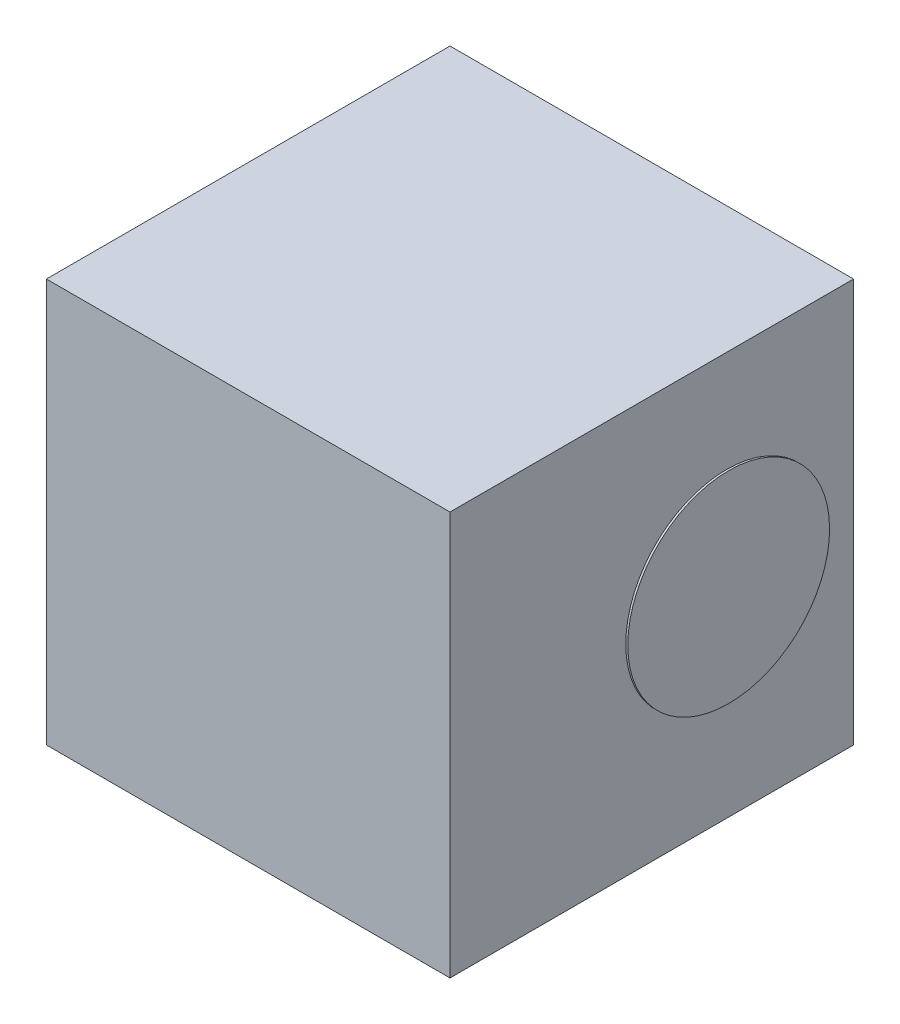
ISO-10303-21;
HEADER;
FILE_DESCRIPTION(('STEP AP214'),'2;1');
FILE_NAME('part.step','',(''),(''),'','','');
FILE_SCHEMA(('AUTOMOTIVE_DESIGN { 1 0 10303 214 1 1 1 1 }'));
ENDSEC;
DATA;
#1=APPLICATION_CONTEXT('core data for automotive mechanical design processes');
#2=APPLICATION_PROTOCOL_DEFINITION('international standard','automotive_design',2000,#1);
#3=PRODUCT_CONTEXT('',#1,'mechanical');
#4=PRODUCT('Part','Part','',(#3));
#5=PRODUCT_RELATED_PRODUCT_CATEGORY('part','',(#4));
#6=PRODUCT_DEFINITION_FORMATION('','',#4);
#7=PRODUCT_DEFINITION_CONTEXT('part definition',#1,'design');
#8=PRODUCT_DEFINITION('design','',#6,#7);
#9=PRODUCT_DEFINITION_SHAPE('','',#8);
#10=(LENGTH_UNIT() NAMED_UNIT(*) SI_UNIT(.MILLI.,.METRE.));
#11=(NAMED_UNIT(*) PLANE_ANGLE_UNIT() SI_UNIT($,.RADIAN.));
#12=(NAMED_UNIT(*) SI_UNIT($,.STERADIAN.) SOLID_ANGLE_UNIT());
#13=UNCERTAINTY_MEASURE_WITH_UNIT(LENGTH_MEASURE(1.E-05),#10,'distance_accuracy_value','');
#14=(GEOMETRIC_REPRESENTATION_CONTEXT(3) GLOBAL_UNCERTAINTY_ASSIGNED_CONTEXT((#13)) GLOBAL_UNIT_ASSIGNED_CONTEXT((#10,
#11,#12)) REPRESENTATION_CONTEXT('',''));
#15=CARTESIAN_POINT('',(0.,0.,0.));
#16=DIRECTION('',(0.,0.,1.));
#17=DIRECTION('',(1.,0.,0.));
#18=AXIS2_PLACEMENT_3D('',#15,#16,#17);
#19=CARTESIAN_POINT('',(-1.,2.,-1.));
#20=DIRECTION('',(1.,0.,0.));
#21=DIRECTION('',(0.,0.,-1.));
#22=AXIS2_PLACEMENT_3D('',#19,#20,#21);
#23=PLANE('',#22);
#24=DIRECTION('',(0.,0.,1.));
#25=VECTOR('',#24,1.);
#26=CARTESIAN_POINT('',(-1.,0.,-1.));
#27=LINE('',#26,#25);
#28=CARTESIAN_POINT('',(-1.,0.,-1.));
#29=VERTEX_POINT('',#28);
#30=CARTESIAN_POINT('',(-1.,0.,1.));
#31=VERTEX_POINT('',#30);
#32=EDGE_CURVE('E100',#29,#31,#27,.T.);
#33=ORIENTED_EDGE('',*,*,#32,.T.);
#34=DIRECTION('',(0.,-1.,0.));
#35=VECTOR('',#34,1.);
#36=CARTESIAN_POINT('',(-1.,2.,1.));
#37=LINE('',#36,#35);
#38=CARTESIAN_POINT('',(-1.,2.,1.));
#39=VERTEX_POINT('',#38);
#40=EDGE_CURVE('E42',#39,#31,#37,.T.);
#41=ORIENTED_EDGE('',*,*,#40,.F.);
#42=DIRECTION('',(0.,0.,1.));
#43=VECTOR('',#42,1.);
#44=CARTESIAN_POINT('',(-1.,2.,-1.));
#45=LINE('',#44,#43);
#46=CARTESIAN_POINT('',(-1.,2.,-1.));
#47=VERTEX_POINT('',#46);
#48=EDGE_CURVE('E86',#47,#39,#45,.T.);
#49=ORIENTED_EDGE('',*,*,#48,.F.);
#50=DIRECTION('',(0.,-1.,0.));
#51=VECTOR('',#50,1.);
#52=CARTESIAN_POINT('',(-1.,2.,-1.));
#53=LINE('',#52,#51);
#54=EDGE_CURVE('E96',#47,#29,#53,.T.);
#55=ORIENTED_EDGE('',*,*,#54,.T.);
#56=EDGE_LOOP('',(#33,#41,#49,#55));
#57=FACE_BOUND('',#56,.T.);
#58=ADVANCED_FACE('F34',(#57),#23,.F.);
#59=CARTESIAN_POINT('',(-1.,2.,1.));
#60=DIRECTION('',(0.,0.,-1.));
#61=DIRECTION('',(-1.,0.,0.));
#62=AXIS2_PLACEMENT_3D('',#59,#60,#61);
#63=PLANE('',#62);
#64=DIRECTION('',(1.,0.,0.));
#65=VECTOR('',#64,1.);
#66=CARTESIAN_POINT('',(-1.,0.,1.));
#67=LINE('',#66,#65);
#68=CARTESIAN_POINT('',(1.,0.,1.));
#69=VERTEX_POINT('',#68);
#70=EDGE_CURVE('E91',#31,#69,#67,.T.);
#71=ORIENTED_EDGE('',*,*,#70,.T.);
#72=DIRECTION('',(0.,-1.,0.));
#73=VECTOR('',#72,1.);
#74=CARTESIAN_POINT('',(1.,2.,1.));
#75=LINE('',#74,#73);
#76=CARTESIAN_POINT('',(1.,2.,1.));
#77=VERTEX_POINT('',#76);
#78=EDGE_CURVE('E89',#77,#69,#75,.T.);
#79=ORIENTED_EDGE('',*,*,#78,.F.);
#80=DIRECTION('',(1.,0.,0.));
#81=VECTOR('',#80,1.);
#82=CARTESIAN_POINT('',(-1.,2.,1.));
#83=LINE('',#82,#81);
#84=EDGE_CURVE('E81',#39,#77,#83,.T.);
#85=ORIENTED_EDGE('',*,*,#84,.F.);
#86=ORIENTED_EDGE('',*,*,#40,.T.);
#87=EDGE_LOOP('',(#71,#79,#85,#86));
#88=FACE_BOUND('',#87,.T.);
#89=ADVANCED_FACE('F90',(#88),#63,.F.);
#90=CARTESIAN_POINT('',(1.,2.,-1.));
#91=DIRECTION('',(-1.,0.,0.));
#92=DIRECTION('',(0.,0.,1.));
#93=AXIS2_PLACEMENT_3D('',#90,#91,#92);
#94=PLANE('',#93);
#95=CARTESIAN_POINT('',(1.,0.997145201259133,-0.37112383631371));
#96=DIRECTION('',(-1.,0.,0.));
#97=DIRECTION('',(0.,0.,1.));
#98=AXIS2_PLACEMENT_3D('',#95,#96,#97);
#99=CIRCLE('',#98,0.5);
#100=CARTESIAN_POINT('',(1.,0.997145201259133,0.12887616368629));
#101=VERTEX_POINT('',#100);
#102=EDGE_CURVE('E11',#101,#101,#99,.F.);
#103=ORIENTED_EDGE('',*,*,#102,.F.);
#104=EDGE_LOOP('',(#103));
#105=FACE_BOUND('',#104,.T.);
#106=DIRECTION('',(0.,0.,-1.));
#107=VECTOR('',#106,1.);
#108=CARTESIAN_POINT('',(1.,0.,-1.));
#109=LINE('',#108,#107);
#110=CARTESIAN_POINT('',(1.,0.,-1.));
#111=VERTEX_POINT('',#110);
#112=EDGE_CURVE('E67',#69,#111,#109,.T.);
#113=ORIENTED_EDGE('',*,*,#112,.T.);
#114=DIRECTION('',(0.,-1.,0.));
#115=VECTOR('',#114,1.);
#116=CARTESIAN_POINT('',(1.,2.,-1.));
#117=LINE('',#116,#115);
#118=CARTESIAN_POINT('',(1.,2.,-1.));
#119=VERTEX_POINT('',#118);
#120=EDGE_CURVE('E92',#119,#111,#117,.T.);
#121=ORIENTED_EDGE('',*,*,#120,.F.);
#122=DIRECTION('',(0.,0.,-1.));
#123=VECTOR('',#122,1.);
#124=CARTESIAN_POINT('',(1.,2.,-1.));
#125=LINE('',#124,#123);
#126=EDGE_CURVE('E84',#77,#119,#125,.T.);
#127=ORIENTED_EDGE('',*,*,#126,.F.);
#128=ORIENTED_EDGE('',*,*,#78,.T.);
#129=EDGE_LOOP('',(#113,#121,#127,#128));
#130=FACE_BOUND('',#129,.T.);
#131=ADVANCED_FACE('F94',(#105,#130),#94,.F.);
#132=CARTESIAN_POINT('',(-1.,2.,-1.));
#133=DIRECTION('',(0.,0.,1.));
#134=DIRECTION('',(1.,0.,0.));
#135=AXIS2_PLACEMENT_3D('',#132,#133,#134);
#136=PLANE('',#135);
#137=DIRECTION('',(-1.,0.,0.));
#138=VECTOR('',#137,1.);
#139=CARTESIAN_POINT('',(-1.,0.,-1.));
#140=LINE('',#139,#138);
#141=EDGE_CURVE('E73',#111,#29,#140,.T.);
#142=ORIENTED_EDGE('',*,*,#141,.T.);
#143=ORIENTED_EDGE('',*,*,#54,.F.);
#144=DIRECTION('',(-1.,0.,0.));
#145=VECTOR('',#144,1.);
#146=CARTESIAN_POINT('',(-1.,2.,-1.));
#147=LINE('',#146,#145);
#148=EDGE_CURVE('E50',#119,#47,#147,.T.);
#149=ORIENTED_EDGE('',*,*,#148,.F.);
#150=ORIENTED_EDGE('',*,*,#120,.T.);
#151=EDGE_LOOP('',(#142,#143,#149,#150));
#152=FACE_BOUND('',#151,.T.);
#153=ADVANCED_FACE('F122',(#152),#136,.F.);
#154=CARTESIAN_POINT('',(0.,2.,0.));
#155=DIRECTION('',(0.,1.,0.));
#156=DIRECTION('',(0.,0.,1.));
#157=AXIS2_PLACEMENT_3D('',#154,#155,#156);
#158=PLANE('',#157);
#159=ORIENTED_EDGE('',*,*,#48,.T.);
#160=ORIENTED_EDGE('',*,*,#84,.T.);
#161=ORIENTED_EDGE('',*,*,#126,.T.);
#162=ORIENTED_EDGE('',*,*,#148,.T.);
#163=EDGE_LOOP('',(#159,#160,#161,#162));
#164=FACE_BOUND('',#163,.T.);
#165=ADVANCED_FACE('F82',(#164),#158,.T.);
#166=CARTESIAN_POINT('',(0.,0.,0.));
#167=DIRECTION('',(0.,1.,0.));
#168=DIRECTION('',(0.,0.,1.));
#169=AXIS2_PLACEMENT_3D('',#166,#167,#168);
#170=PLANE('',#169);
#171=ORIENTED_EDGE('',*,*,#32,.F.);
#172=ORIENTED_EDGE('',*,*,#141,.F.);
#173=ORIENTED_EDGE('',*,*,#112,.F.);
#174=ORIENTED_EDGE('',*,*,#70,.F.);
#175=EDGE_LOOP('',(#171,#172,#173,#174));
#176=FACE_BOUND('',#175,.T.);
#177=ADVANCED_FACE('F111',(#176),#170,.F.);
#178=CARTESIAN_POINT('',(1.01,0.997145201259133,-0.37112383631371));
#179=DIRECTION('',(-1.,0.,0.));
#180=DIRECTION('',(0.,0.,1.));
#181=AXIS2_PLACEMENT_3D('',#178,#179,#180);
#182=CYLINDRICAL_SURFACE('',#181,0.5);
#183=CARTESIAN_POINT('',(1.01,0.997145201259133,-0.37112383631371));
#184=DIRECTION('',(1.,0.,0.));
#185=DIRECTION('',(0.,0.,-1.));
#186=AXIS2_PLACEMENT_3D('',#183,#184,#185);
#187=CIRCLE('',#186,0.5);
#188=CARTESIAN_POINT('',(1.01,0.997145201259133,-0.87112383631371));
#189=VERTEX_POINT('',#188);
#190=EDGE_CURVE('E103',#189,#189,#187,.T.);
#191=ORIENTED_EDGE('',*,*,#190,.F.);
#192=EDGE_LOOP('',(#191));
#193=FACE_BOUND('',#192,.T.);
#194=ORIENTED_EDGE('',*,*,#102,.T.);
#195=EDGE_LOOP('',(#194));
#196=FACE_BOUND('',#195,.T.);
#197=ADVANCED_FACE('F113',(#193,#196),#182,.T.);
#198=CARTESIAN_POINT('',(1.01,0.997145201259133,-0.37112383631371));
#199=DIRECTION('',(1.,0.,0.));
#200=DIRECTION('',(0.,0.,-1.));
#201=AXIS2_PLACEMENT_3D('',#198,#199,#200);
#202=PLANE('',#201);
#203=ORIENTED_EDGE('',*,*,#190,.T.);
#204=EDGE_LOOP('',(#203));
#205=FACE_BOUND('',#204,.T.);
#206=ADVANCED_FACE('F119',(#205),#202,.T.);
#207=CLOSED_SHELL('',(#58,#89,#131,#153,#165,#177,#197,#206));
#208=MANIFOLD_SOLID_BREP('B2',#207);
#209=ADVANCED_BREP_SHAPE_REPRESENTATION('',(#18,#208),#14);
#210=SHAPE_DEFINITION_REPRESENTATION(#9,#209);
ENDSEC;
END-ISO-10303-21;
